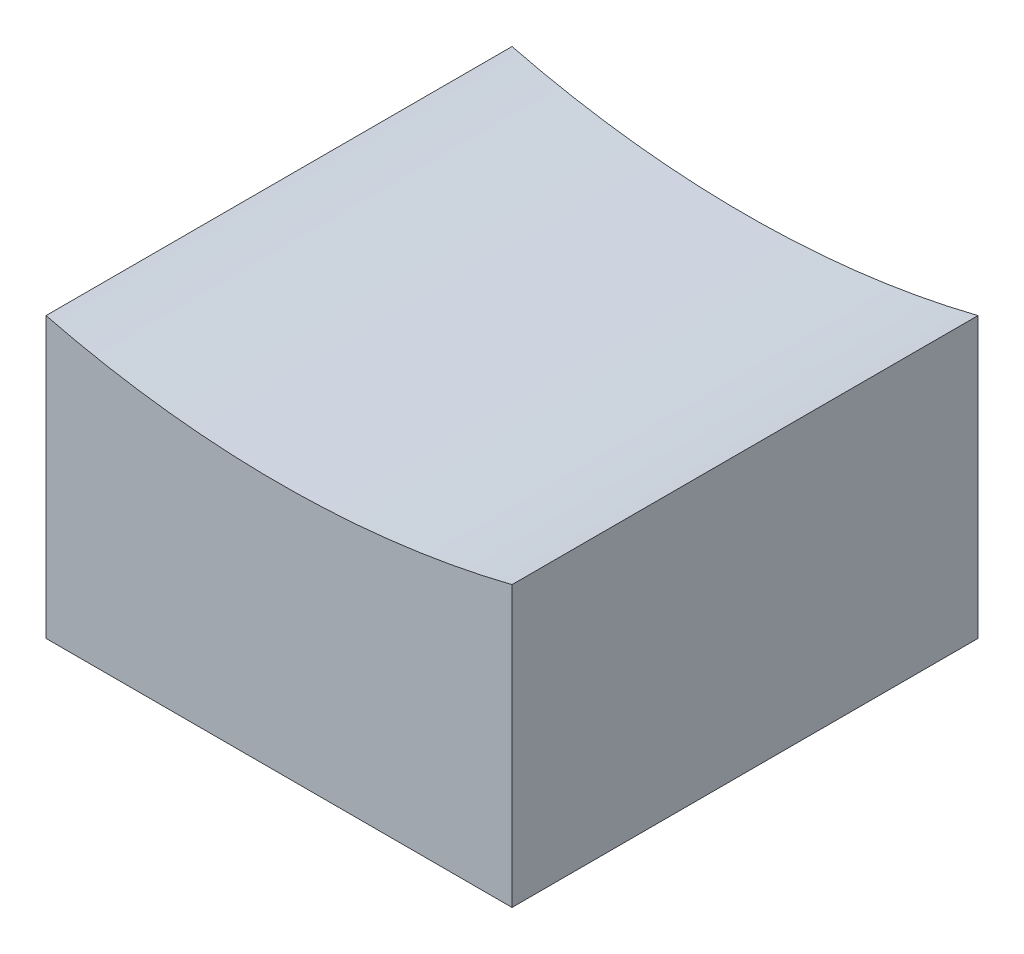
ISO-10303-21;
HEADER;
FILE_DESCRIPTION(('STEP AP214'),'2;1');
FILE_NAME('part.step','',(''),(''),'','','');
FILE_SCHEMA(('AUTOMOTIVE_DESIGN { 1 0 10303 214 1 1 1 1 }'));
ENDSEC;
DATA;
#1=APPLICATION_CONTEXT('core data for automotive mechanical design processes');
#2=APPLICATION_PROTOCOL_DEFINITION('international standard','automotive_design',2000,#1);
#3=PRODUCT_CONTEXT('',#1,'mechanical');
#4=PRODUCT('Part','Part','',(#3));
#5=PRODUCT_RELATED_PRODUCT_CATEGORY('part','',(#4));
#6=PRODUCT_DEFINITION_FORMATION('','',#4);
#7=PRODUCT_DEFINITION_CONTEXT('part definition',#1,'design');
#8=PRODUCT_DEFINITION('design','',#6,#7);
#9=PRODUCT_DEFINITION_SHAPE('','',#8);
#10=(LENGTH_UNIT() NAMED_UNIT(*) SI_UNIT(.MILLI.,.METRE.));
#11=(NAMED_UNIT(*) PLANE_ANGLE_UNIT() SI_UNIT($,.RADIAN.));
#12=(NAMED_UNIT(*) SI_UNIT($,.STERADIAN.) SOLID_ANGLE_UNIT());
#13=UNCERTAINTY_MEASURE_WITH_UNIT(LENGTH_MEASURE(1.E-05),#10,'distance_accuracy_value','');
#14=(GEOMETRIC_REPRESENTATION_CONTEXT(3) GLOBAL_UNCERTAINTY_ASSIGNED_CONTEXT((#13)) GLOBAL_UNIT_ASSIGNED_CONTEXT((#10,
#11,#12)) REPRESENTATION_CONTEXT('',''));
#15=CARTESIAN_POINT('',(0.,0.,0.));
#16=DIRECTION('',(0.,0.,1.));
#17=DIRECTION('',(1.,0.,0.));
#18=AXIS2_PLACEMENT_3D('',#15,#16,#17);
#19=CARTESIAN_POINT('',(2.5,0.,5.));
#20=DIRECTION('',(-1.,0.,0.));
#21=DIRECTION('',(0.,0.,1.));
#22=AXIS2_PLACEMENT_3D('',#19,#20,#21);
#23=PLANE('',#22);
#24=DIRECTION('',(0.,1.,0.));
#25=VECTOR('',#24,1.);
#26=CARTESIAN_POINT('',(2.5,0.,0.));
#27=LINE('',#26,#25);
#28=CARTESIAN_POINT('',(2.5,0.,0.));
#29=VERTEX_POINT('',#28);
#30=CARTESIAN_POINT('',(2.5,3.,0.));
#31=VERTEX_POINT('',#30);
#32=EDGE_CURVE('E107',#29,#31,#27,.T.);
#33=ORIENTED_EDGE('',*,*,#32,.T.);
#34=DIRECTION('',(0.,0.,-1.));
#35=VECTOR('',#34,1.);
#36=CARTESIAN_POINT('',(2.5,3.,5.));
#37=LINE('',#36,#35);
#38=CARTESIAN_POINT('',(2.5,3.,5.));
#39=VERTEX_POINT('',#38);
#40=EDGE_CURVE('E11',#39,#31,#37,.T.);
#41=ORIENTED_EDGE('',*,*,#40,.F.);
#42=DIRECTION('',(0.,1.,0.));
#43=VECTOR('',#42,1.);
#44=CARTESIAN_POINT('',(2.5,0.,5.));
#45=LINE('',#44,#43);
#46=CARTESIAN_POINT('',(2.5,0.,5.));
#47=VERTEX_POINT('',#46);
#48=EDGE_CURVE('E91',#47,#39,#45,.T.);
#49=ORIENTED_EDGE('',*,*,#48,.F.);
#50=DIRECTION('',(0.,0.,-1.));
#51=VECTOR('',#50,1.);
#52=CARTESIAN_POINT('',(2.5,0.,5.));
#53=LINE('',#52,#51);
#54=EDGE_CURVE('E103',#47,#29,#53,.T.);
#55=ORIENTED_EDGE('',*,*,#54,.T.);
#56=EDGE_LOOP('',(#33,#41,#49,#55));
#57=FACE_BOUND('',#56,.T.);
#58=ADVANCED_FACE('F39',(#57),#23,.F.);
#59=CARTESIAN_POINT('',(0.,12.9719979577677,5.));
#60=DIRECTION('',(0.,0.,-1.));
#61=DIRECTION('',(-1.,0.,0.));
#62=AXIS2_PLACEMENT_3D('',#59,#60,#61);
#63=CYLINDRICAL_SURFACE('',#62,10.2806003360564);
#64=CARTESIAN_POINT('',(0.,12.9719979577677,0.));
#65=DIRECTION('',(0.,0.,-1.));
#66=DIRECTION('',(1.,0.,0.));
#67=AXIS2_PLACEMENT_3D('',#64,#65,#66);
#68=CIRCLE('',#67,10.2806003360564);
#69=CARTESIAN_POINT('',(-2.5,3.,0.));
#70=VERTEX_POINT('',#69);
#71=EDGE_CURVE('E96',#31,#70,#68,.T.);
#72=ORIENTED_EDGE('',*,*,#71,.T.);
#73=DIRECTION('',(0.,0.,-1.));
#74=VECTOR('',#73,1.);
#75=CARTESIAN_POINT('',(-2.5,3.,5.));
#76=LINE('',#75,#74);
#77=CARTESIAN_POINT('',(-2.5,3.,5.));
#78=VERTEX_POINT('',#77);
#79=EDGE_CURVE('E48',#78,#70,#76,.T.);
#80=ORIENTED_EDGE('',*,*,#79,.F.);
#81=CARTESIAN_POINT('',(0.,12.9719979577677,5.));
#82=DIRECTION('',(0.,0.,-1.));
#83=DIRECTION('',(1.,0.,0.));
#84=AXIS2_PLACEMENT_3D('',#81,#82,#83);
#85=CIRCLE('',#84,10.2806003360564);
#86=EDGE_CURVE('E86',#39,#78,#85,.T.);
#87=ORIENTED_EDGE('',*,*,#86,.F.);
#88=ORIENTED_EDGE('',*,*,#40,.T.);
#89=EDGE_LOOP('',(#72,#80,#87,#88));
#90=FACE_BOUND('',#89,.T.);
#91=ADVANCED_FACE('F95',(#90),#63,.F.);
#92=CARTESIAN_POINT('',(-2.5,0.,5.));
#93=DIRECTION('',(1.,0.,0.));
#94=DIRECTION('',(0.,0.,-1.));
#95=AXIS2_PLACEMENT_3D('',#92,#93,#94);
#96=PLANE('',#95);
#97=DIRECTION('',(0.,-1.,0.));
#98=VECTOR('',#97,1.);
#99=CARTESIAN_POINT('',(-2.5,0.,0.));
#100=LINE('',#99,#98);
#101=CARTESIAN_POINT('',(-2.5,0.,0.));
#102=VERTEX_POINT('',#101);
#103=EDGE_CURVE('E73',#70,#102,#100,.T.);
#104=ORIENTED_EDGE('',*,*,#103,.T.);
#105=DIRECTION('',(0.,0.,-1.));
#106=VECTOR('',#105,1.);
#107=CARTESIAN_POINT('',(-2.5,0.,5.));
#108=LINE('',#107,#106);
#109=CARTESIAN_POINT('',(-2.5,0.,5.));
#110=VERTEX_POINT('',#109);
#111=EDGE_CURVE('E98',#110,#102,#108,.T.);
#112=ORIENTED_EDGE('',*,*,#111,.F.);
#113=DIRECTION('',(0.,-1.,0.));
#114=VECTOR('',#113,1.);
#115=CARTESIAN_POINT('',(-2.5,0.,5.));
#116=LINE('',#115,#114);
#117=EDGE_CURVE('E89',#78,#110,#116,.T.);
#118=ORIENTED_EDGE('',*,*,#117,.F.);
#119=ORIENTED_EDGE('',*,*,#79,.T.);
#120=EDGE_LOOP('',(#104,#112,#118,#119));
#121=FACE_BOUND('',#120,.T.);
#122=ADVANCED_FACE('F99',(#121),#96,.F.);
#123=CARTESIAN_POINT('',(-2.5,0.,5.));
#124=DIRECTION('',(0.,1.,0.));
#125=DIRECTION('',(-1.,0.,0.));
#126=AXIS2_PLACEMENT_3D('',#123,#124,#125);
#127=PLANE('',#126);
#128=DIRECTION('',(1.,0.,0.));
#129=VECTOR('',#128,1.);
#130=CARTESIAN_POINT('',(-2.5,0.,0.));
#131=LINE('',#130,#129);
#132=EDGE_CURVE('E79',#102,#29,#131,.T.);
#133=ORIENTED_EDGE('',*,*,#132,.T.);
#134=ORIENTED_EDGE('',*,*,#54,.F.);
#135=DIRECTION('',(1.,0.,0.));
#136=VECTOR('',#135,1.);
#137=CARTESIAN_POINT('',(-2.5,0.,5.));
#138=LINE('',#137,#136);
#139=EDGE_CURVE('E56',#110,#47,#138,.T.);
#140=ORIENTED_EDGE('',*,*,#139,.F.);
#141=ORIENTED_EDGE('',*,*,#111,.T.);
#142=EDGE_LOOP('',(#133,#134,#140,#141));
#143=FACE_BOUND('',#142,.T.);
#144=ADVANCED_FACE('F120',(#143),#127,.F.);
#145=CARTESIAN_POINT('',(0.,12.9719979577677,5.));
#146=DIRECTION('',(0.,0.,1.));
#147=DIRECTION('',(1.,0.,0.));
#148=AXIS2_PLACEMENT_3D('',#145,#146,#147);
#149=PLANE('',#148);
#150=ORIENTED_EDGE('',*,*,#48,.T.);
#151=ORIENTED_EDGE('',*,*,#86,.T.);
#152=ORIENTED_EDGE('',*,*,#117,.T.);
#153=ORIENTED_EDGE('',*,*,#139,.T.);
#154=EDGE_LOOP('',(#150,#151,#152,#153));
#155=FACE_BOUND('',#154,.T.);
#156=ADVANCED_FACE('F87',(#155),#149,.T.);
#157=CARTESIAN_POINT('',(0.,12.9719979577677,0.));
#158=DIRECTION('',(0.,0.,1.));
#159=DIRECTION('',(1.,0.,0.));
#160=AXIS2_PLACEMENT_3D('',#157,#158,#159);
#161=PLANE('',#160);
#162=ORIENTED_EDGE('',*,*,#32,.F.);
#163=ORIENTED_EDGE('',*,*,#132,.F.);
#164=ORIENTED_EDGE('',*,*,#103,.F.);
#165=ORIENTED_EDGE('',*,*,#71,.F.);
#166=EDGE_LOOP('',(#162,#163,#164,#165));
#167=FACE_BOUND('',#166,.T.);
#168=ADVANCED_FACE('F123',(#167),#161,.F.);
#169=CLOSED_SHELL('',(#58,#91,#122,#144,#156,#168));
#170=MANIFOLD_SOLID_BREP('B2',#169);
#171=ADVANCED_BREP_SHAPE_REPRESENTATION('',(#18,#170),#14);
#172=SHAPE_DEFINITION_REPRESENTATION(#9,#171);
ENDSEC;
END-ISO-10303-21;
